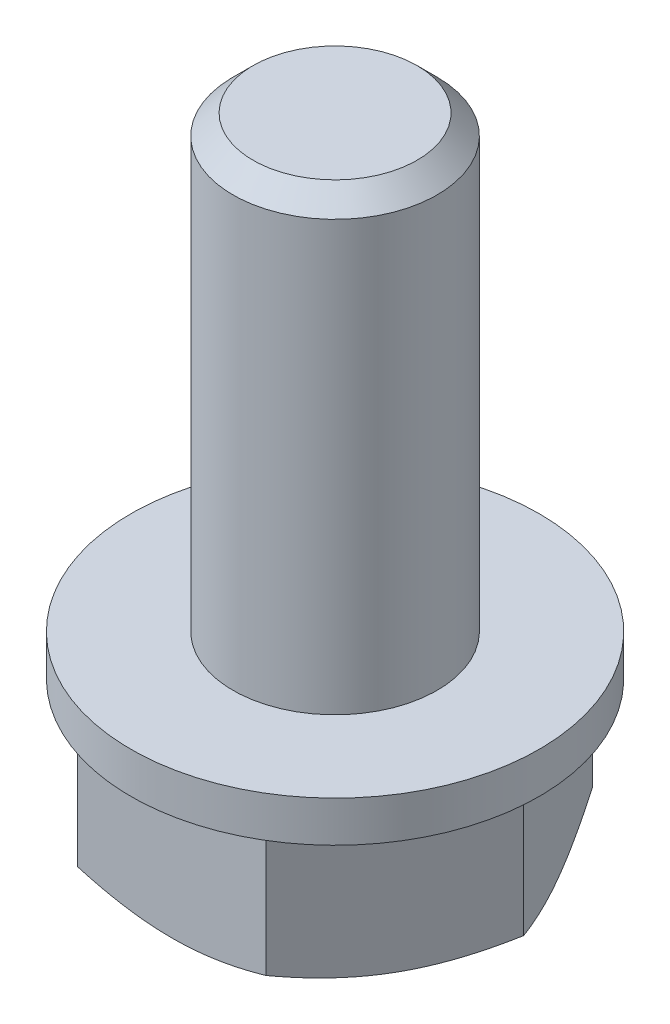
ISO-10303-21;
HEADER;
FILE_DESCRIPTION(('STEP AP214'),'2;1');
FILE_NAME('part.step','',(''),(''),'','','');
FILE_SCHEMA(('AUTOMOTIVE_DESIGN { 1 0 10303 214 1 1 1 1 }'));
ENDSEC;
DATA;
#1=APPLICATION_CONTEXT('core data for automotive mechanical design processes');
#2=APPLICATION_PROTOCOL_DEFINITION('international standard','automotive_design',2000,#1);
#3=PRODUCT_CONTEXT('',#1,'mechanical');
#4=PRODUCT('Part','Part','',(#3));
#5=PRODUCT_RELATED_PRODUCT_CATEGORY('part','',(#4));
#6=PRODUCT_DEFINITION_FORMATION('','',#4);
#7=PRODUCT_DEFINITION_CONTEXT('part definition',#1,'design');
#8=PRODUCT_DEFINITION('design','',#6,#7);
#9=PRODUCT_DEFINITION_SHAPE('','',#8);
#10=(LENGTH_UNIT() NAMED_UNIT(*) SI_UNIT(.MILLI.,.METRE.));
#11=(NAMED_UNIT(*) PLANE_ANGLE_UNIT() SI_UNIT($,.RADIAN.));
#12=(NAMED_UNIT(*) SI_UNIT($,.STERADIAN.) SOLID_ANGLE_UNIT());
#13=UNCERTAINTY_MEASURE_WITH_UNIT(LENGTH_MEASURE(1.E-05),#10,'distance_accuracy_value','');
#14=(GEOMETRIC_REPRESENTATION_CONTEXT(3) GLOBAL_UNCERTAINTY_ASSIGNED_CONTEXT((#13)) GLOBAL_UNIT_ASSIGNED_CONTEXT((#10,
#11,#12)) REPRESENTATION_CONTEXT('',''));
#15=CARTESIAN_POINT('',(0.,0.,0.));
#16=DIRECTION('',(0.,0.,1.));
#17=DIRECTION('',(1.,0.,0.));
#18=AXIS2_PLACEMENT_3D('',#15,#16,#17);
#19=CARTESIAN_POINT('',(12.374368670765,-45.18,10.374368670765));
#20=DIRECTION('',(0.,-1.,0.));
#21=DIRECTION('',(0.,0.,-1.));
#22=AXIS2_PLACEMENT_3D('',#19,#20,#21);
#23=PLANE('',#22);
#24=CARTESIAN_POINT('',(12.374368670765,-45.18,12.374368670765));
#25=DIRECTION('',(0.,-1.,0.));
#26=DIRECTION('',(0.,0.,-1.));
#27=AXIS2_PLACEMENT_3D('',#24,#25,#26);
#28=CIRCLE('',#27,4.);
#29=CARTESIAN_POINT('',(12.374368670765,-45.18,8.374368670765));
#30=VERTEX_POINT('',#29);
#31=CARTESIAN_POINT('',(15.8384702859027,-45.18,10.374368670765));
#32=VERTEX_POINT('',#31);
#33=EDGE_CURVE('E146',#30,#32,#28,.T.);
#34=ORIENTED_EDGE('',*,*,#33,.T.);
#35=CARTESIAN_POINT('',(12.374368670765,-45.18,12.374368670765));
#36=DIRECTION('',(0.,-1.,0.));
#37=DIRECTION('',(0.,0.,-1.));
#38=AXIS2_PLACEMENT_3D('',#35,#36,#37);
#39=CIRCLE('',#38,4.);
#40=CARTESIAN_POINT('',(15.8384702859027,-45.18,14.374368670765));
#41=VERTEX_POINT('',#40);
#42=EDGE_CURVE('E164',#32,#41,#39,.T.);
#43=ORIENTED_EDGE('',*,*,#42,.T.);
#44=CARTESIAN_POINT('',(12.374368670765,-45.18,12.374368670765));
#45=DIRECTION('',(0.,-1.,0.));
#46=DIRECTION('',(0.,0.,-1.));
#47=AXIS2_PLACEMENT_3D('',#44,#45,#46);
#48=CIRCLE('',#47,4.);
#49=CARTESIAN_POINT('',(12.374368670765,-45.18,16.374368670765));
#50=VERTEX_POINT('',#49);
#51=EDGE_CURVE('E142',#41,#50,#48,.T.);
#52=ORIENTED_EDGE('',*,*,#51,.T.);
#53=CARTESIAN_POINT('',(12.374368670765,-45.18,12.374368670765));
#54=DIRECTION('',(0.,-1.,0.));
#55=DIRECTION('',(0.,0.,-1.));
#56=AXIS2_PLACEMENT_3D('',#53,#54,#55);
#57=CIRCLE('',#56,4.);
#58=CARTESIAN_POINT('',(8.91026705562725,-45.18,14.374368670765));
#59=VERTEX_POINT('',#58);
#60=EDGE_CURVE('E138',#50,#59,#57,.T.);
#61=ORIENTED_EDGE('',*,*,#60,.T.);
#62=CARTESIAN_POINT('',(12.374368670765,-45.18,12.374368670765));
#63=DIRECTION('',(0.,-1.,0.));
#64=DIRECTION('',(0.,0.,-1.));
#65=AXIS2_PLACEMENT_3D('',#62,#63,#64);
#66=CIRCLE('',#65,4.);
#67=CARTESIAN_POINT('',(8.91026705562725,-45.18,10.374368670765));
#68=VERTEX_POINT('',#67);
#69=EDGE_CURVE('E108',#59,#68,#66,.T.);
#70=ORIENTED_EDGE('',*,*,#69,.T.);
#71=CARTESIAN_POINT('',(12.374368670765,-45.18,12.374368670765));
#72=DIRECTION('',(0.,-1.,0.));
#73=DIRECTION('',(0.,0.,-1.));
#74=AXIS2_PLACEMENT_3D('',#71,#72,#73);
#75=CIRCLE('',#74,4.);
#76=EDGE_CURVE('E112',#68,#30,#75,.T.);
#77=ORIENTED_EDGE('',*,*,#76,.T.);
#78=EDGE_LOOP('',(#34,#43,#52,#61,#70,#77));
#79=FACE_BOUND('',#78,.T.);
#80=ADVANCED_FACE('F16',(#79),#23,.T.);
#81=CARTESIAN_POINT('',(12.374368670765,-42.6413248654052,12.374368670765));
#82=DIRECTION('',(0.,1.,0.));
#83=DIRECTION('',(0.,0.,-1.));
#84=AXIS2_PLACEMENT_3D('',#81,#82,#83);
#85=CYLINDRICAL_SURFACE('',#84,5.);
#86=CARTESIAN_POINT('',(12.374368670765,-40.68,12.374368670765));
#87=DIRECTION('',(0.,-1.,0.));
#88=DIRECTION('',(0.,0.,-1.));
#89=AXIS2_PLACEMENT_3D('',#86,#87,#88);
#90=CIRCLE('',#89,5.);
#91=CARTESIAN_POINT('',(12.374368670765,-40.68,7.374368670765));
#92=VERTEX_POINT('',#91);
#93=EDGE_CURVE('E11',#92,#92,#90,.T.);
#94=ORIENTED_EDGE('',*,*,#93,.T.);
#95=EDGE_LOOP('',(#94));
#96=FACE_BOUND('',#95,.T.);
#97=CARTESIAN_POINT('',(12.374368670765,-41.68,12.374368670765));
#98=DIRECTION('',(0.,1.,0.));
#99=DIRECTION('',(0.,0.,-1.));
#100=AXIS2_PLACEMENT_3D('',#97,#98,#99);
#101=CIRCLE('',#100,5.);
#102=CARTESIAN_POINT('',(12.374368670765,-41.68,7.374368670765));
#103=VERTEX_POINT('',#102);
#104=EDGE_CURVE('E105',#103,#103,#101,.T.);
#105=ORIENTED_EDGE('',*,*,#104,.T.);
#106=EDGE_LOOP('',(#105));
#107=FACE_BOUND('',#106,.T.);
#108=ADVANCED_FACE('F106',(#96,#107),#85,.T.);
#109=CARTESIAN_POINT('',(12.374368670765,-40.68,8.624368670765));
#110=DIRECTION('',(0.,1.,0.));
#111=DIRECTION('',(0.,0.,1.));
#112=AXIS2_PLACEMENT_3D('',#109,#110,#111);
#113=PLANE('',#112);
#114=CARTESIAN_POINT('',(12.374368670765,-40.68,12.374368670765));
#115=DIRECTION('',(0.,-1.,0.));
#116=DIRECTION('',(0.,0.,-1.));
#117=AXIS2_PLACEMENT_3D('',#114,#115,#116);
#118=CIRCLE('',#117,2.5);
#119=CARTESIAN_POINT('',(12.374368670765,-40.68,9.874368670765));
#120=VERTEX_POINT('',#119);
#121=EDGE_CURVE('E26',#120,#120,#118,.T.);
#122=ORIENTED_EDGE('',*,*,#121,.T.);
#123=EDGE_LOOP('',(#122));
#124=FACE_BOUND('',#123,.T.);
#125=ORIENTED_EDGE('',*,*,#93,.F.);
#126=EDGE_LOOP('',(#125));
#127=FACE_BOUND('',#126,.T.);
#128=ADVANCED_FACE('F304',(#124,#127),#113,.T.);
#129=CARTESIAN_POINT('',(12.374368670765,-35.42525,12.374368670765));
#130=DIRECTION('',(0.,1.,0.));
#131=DIRECTION('',(0.,0.,-1.));
#132=AXIS2_PLACEMENT_3D('',#129,#130,#131);
#133=CYLINDRICAL_SURFACE('',#132,2.5);
#134=CARTESIAN_POINT('',(12.374368670765,-30.1705,12.374368670765));
#135=DIRECTION('',(0.,-1.,0.));
#136=DIRECTION('',(0.,0.,-1.));
#137=AXIS2_PLACEMENT_3D('',#134,#135,#136);
#138=CIRCLE('',#137,2.5);
#139=CARTESIAN_POINT('',(12.374368670765,-30.1705,9.874368670765));
#140=VERTEX_POINT('',#139);
#141=EDGE_CURVE('E130',#140,#140,#138,.T.);
#142=ORIENTED_EDGE('',*,*,#141,.T.);
#143=EDGE_LOOP('',(#142));
#144=FACE_BOUND('',#143,.T.);
#145=ORIENTED_EDGE('',*,*,#121,.F.);
#146=EDGE_LOOP('',(#145));
#147=FACE_BOUND('',#146,.T.);
#148=ADVANCED_FACE('F323',(#144,#147),#133,.T.);
#149=CARTESIAN_POINT('',(12.374368670765,-29.92525,12.374368670765));
#150=DIRECTION('',(0.,-1.,0.));
#151=DIRECTION('',(0.,0.,-1.));
#152=AXIS2_PLACEMENT_3D('',#149,#150,#151);
#153=CONICAL_SURFACE('',#152,2.25475,0.785398163397448);
#154=CARTESIAN_POINT('',(12.374368670765,-29.68,12.374368670765));
#155=DIRECTION('',(0.,-1.,0.));
#156=DIRECTION('',(0.,0.,-1.));
#157=AXIS2_PLACEMENT_3D('',#154,#155,#156);
#158=CIRCLE('',#157,2.0095);
#159=CARTESIAN_POINT('',(12.374368670765,-29.68,10.364868670765));
#160=VERTEX_POINT('',#159);
#161=EDGE_CURVE('E134',#160,#160,#158,.T.);
#162=ORIENTED_EDGE('',*,*,#161,.T.);
#163=EDGE_LOOP('',(#162));
#164=FACE_BOUND('',#163,.T.);
#165=ORIENTED_EDGE('',*,*,#141,.F.);
#166=EDGE_LOOP('',(#165));
#167=FACE_BOUND('',#166,.T.);
#168=ADVANCED_FACE('F320',(#164,#167),#153,.T.);
#169=CARTESIAN_POINT('',(12.374368670765,-29.68,11.369618670765));
#170=DIRECTION('',(0.,1.,0.));
#171=DIRECTION('',(0.,0.,1.));
#172=AXIS2_PLACEMENT_3D('',#169,#170,#171);
#173=PLANE('',#172);
#174=ORIENTED_EDGE('',*,*,#161,.F.);
#175=EDGE_LOOP('',(#174));
#176=FACE_BOUND('',#175,.T.);
#177=ADVANCED_FACE('F18',(#176),#173,.T.);
#178=CARTESIAN_POINT('',(12.374368670765,-44.8913248654052,12.374368670765));
#179=DIRECTION('',(0.,1.,0.));
#180=DIRECTION('',(0.,0.,-1.));
#181=AXIS2_PLACEMENT_3D('',#178,#179,#180);
#182=CONICAL_SURFACE('',#181,4.5,1.04719755119662);
#183=CARTESIAN_POINT('',(12.374368670765,-45.18,16.374368670765));
#184=CARTESIAN_POINT('',(11.302571901033,-45.18,16.374368670765));
#185=CARTESIAN_POINT('',(10.0649675940065,-44.8227344100918,16.374368670765));
#186=(BOUNDED_CURVE() B_SPLINE_CURVE(2,(#183,#184,#185),.UNSPECIFIED.,.F.,
.F.) B_SPLINE_CURVE_WITH_KNOTS((3,3),(3.06610202231448,5.50179922142013),
.UNSPECIFIED.) CURVE() GEOMETRIC_REPRESENTATION_ITEM() RATIONAL_B_SPLINE_CURVE((1.,
1.04818815858901,1.01981541864881)) REPRESENTATION_ITEM(''));
#187=CARTESIAN_POINT('',(10.0649675940065,-44.8227344100919,16.374368670765));
#188=VERTEX_POINT('',#187);
#189=EDGE_CURVE('E181',#50,#188,#186,.T.);
#190=ORIENTED_EDGE('',*,*,#189,.T.);
#191=CARTESIAN_POINT('',(10.0649675940065,-44.8227344100918,16.374368670765));
#192=CARTESIAN_POINT('',(9.44616544048951,-45.1799999999999,15.3025719010405));
#193=CARTESIAN_POINT('',(8.91026705562725,-45.18,14.374368670765));
#194=(BOUNDED_CURVE() B_SPLINE_CURVE(2,(#191,#192,#193),.UNSPECIFIED.,.F.,
.F.) B_SPLINE_CURVE_WITH_KNOTS((3,3),(0.630404823226759,3.06610202231449),
.UNSPECIFIED.) CURVE() GEOMETRIC_REPRESENTATION_ITEM() RATIONAL_B_SPLINE_CURVE((1.01981541864924,
1.04818815858868,1.)) REPRESENTATION_ITEM(''));
#195=EDGE_CURVE('E114',#188,#59,#194,.T.);
#196=ORIENTED_EDGE('',*,*,#195,.T.);
#197=ORIENTED_EDGE('',*,*,#60,.F.);
#198=EDGE_LOOP('',(#190,#196,#197));
#199=FACE_BOUND('',#198,.T.);
#200=ADVANCED_FACE('F256',(#199),#182,.T.);
#201=CARTESIAN_POINT('',(12.374368670765,-44.8913248654052,12.374368670765));
#202=DIRECTION('',(0.,1.,0.));
#203=DIRECTION('',(0.,0.,-1.));
#204=AXIS2_PLACEMENT_3D('',#201,#202,#203);
#205=CONICAL_SURFACE('',#204,4.5,1.04719755119662);
#206=CARTESIAN_POINT('',(15.8384702859027,-45.18,14.374368670765));
#207=CARTESIAN_POINT('',(15.3025719010368,-45.18,15.3025719010471));
#208=CARTESIAN_POINT('',(14.6837697475235,-44.8227344100919,16.374368670765));
#209=(BOUNDED_CURVE() B_SPLINE_CURVE(2,(#206,#207,#208),.UNSPECIFIED.,.F.,
.F.) B_SPLINE_CURVE_WITH_KNOTS((3,3),(3.06610202231449,5.50179922142015),
.UNSPECIFIED.) CURVE() GEOMETRIC_REPRESENTATION_ITEM() RATIONAL_B_SPLINE_CURVE((1.,
1.04818815858904,1.01981541864882)) REPRESENTATION_ITEM(''));
#210=CARTESIAN_POINT('',(14.6837697475235,-44.8227344100919,16.374368670765));
#211=VERTEX_POINT('',#210);
#212=EDGE_CURVE('E150',#41,#211,#209,.T.);
#213=ORIENTED_EDGE('',*,*,#212,.T.);
#214=CARTESIAN_POINT('',(14.6837697475235,-44.8227344100919,16.374368670765));
#215=CARTESIAN_POINT('',(13.4461654404895,-45.1800000000001,16.374368670765));
#216=CARTESIAN_POINT('',(12.374368670765,-45.18,16.374368670765));
#217=(BOUNDED_CURVE() B_SPLINE_CURVE(2,(#214,#215,#216),.UNSPECIFIED.,.F.,
.F.) B_SPLINE_CURVE_WITH_KNOTS((3,3),(0.630404823226771,3.06610202231448),
.UNSPECIFIED.) CURVE() GEOMETRIC_REPRESENTATION_ITEM() RATIONAL_B_SPLINE_CURVE((1.01981541864923,
1.04818815858865,1.)) REPRESENTATION_ITEM(''));
#218=EDGE_CURVE('E156',#211,#50,#217,.T.);
#219=ORIENTED_EDGE('',*,*,#218,.T.);
#220=ORIENTED_EDGE('',*,*,#51,.F.);
#221=EDGE_LOOP('',(#213,#219,#220));
#222=FACE_BOUND('',#221,.T.);
#223=ADVANCED_FACE('F271',(#222),#205,.T.);
#224=CARTESIAN_POINT('',(12.374368670765,-44.8913248654052,12.374368670765));
#225=DIRECTION('',(0.,1.,0.));
#226=DIRECTION('',(0.,0.,-1.));
#227=AXIS2_PLACEMENT_3D('',#224,#225,#226);
#228=CONICAL_SURFACE('',#227,4.5,1.04719755119662);
#229=CARTESIAN_POINT('',(15.8384702859027,-45.18,10.374368670765));
#230=CARTESIAN_POINT('',(16.3743686707688,-45.18,11.302571901047));
#231=CARTESIAN_POINT('',(16.993170824282,-44.8227344100919,12.374368670765));
#232=(BOUNDED_CURVE() B_SPLINE_CURVE(2,(#229,#230,#231),.UNSPECIFIED.,.F.,
.F.) B_SPLINE_CURVE_WITH_KNOTS((3,3),(3.06610202231449,5.50179922142014),
.UNSPECIFIED.) CURVE() GEOMETRIC_REPRESENTATION_ITEM() RATIONAL_B_SPLINE_CURVE((1.,
1.04818815858902,1.01981541864881)) REPRESENTATION_ITEM(''));
#233=CARTESIAN_POINT('',(16.993170824282,-44.8227344100919,12.374368670765));
#234=VERTEX_POINT('',#233);
#235=EDGE_CURVE('E122',#32,#234,#232,.T.);
#236=ORIENTED_EDGE('',*,*,#235,.T.);
#237=CARTESIAN_POINT('',(16.993170824282,-44.8227344100919,12.374368670765));
#238=CARTESIAN_POINT('',(16.374368670765,-45.1800000000001,13.4461654404895));
#239=CARTESIAN_POINT('',(15.8384702859027,-45.18,14.374368670765));
#240=(BOUNDED_CURVE() B_SPLINE_CURVE(2,(#237,#238,#239),.UNSPECIFIED.,.F.,
.F.) B_SPLINE_CURVE_WITH_KNOTS((3,3),(0.630404823226775,3.06610202231449),
.UNSPECIFIED.) CURVE() GEOMETRIC_REPRESENTATION_ITEM() RATIONAL_B_SPLINE_CURVE((1.01981541864923,
1.04818815858866,1.)) REPRESENTATION_ITEM(''));
#241=EDGE_CURVE('E50',#234,#41,#240,.T.);
#242=ORIENTED_EDGE('',*,*,#241,.T.);
#243=ORIENTED_EDGE('',*,*,#42,.F.);
#244=EDGE_LOOP('',(#236,#242,#243));
#245=FACE_BOUND('',#244,.T.);
#246=ADVANCED_FACE('F288',(#245),#228,.T.);
#247=CARTESIAN_POINT('',(12.374368670765,-44.8913248654052,12.374368670765));
#248=DIRECTION('',(0.,1.,0.));
#249=DIRECTION('',(0.,0.,-1.));
#250=AXIS2_PLACEMENT_3D('',#247,#248,#249);
#251=CONICAL_SURFACE('',#250,4.5,1.04719755119662);
#252=CARTESIAN_POINT('',(14.6837697475235,-44.8227344100918,8.374368670765));
#253=CARTESIAN_POINT('',(15.3025719010405,-45.1799999999999,9.44616544048947));
#254=CARTESIAN_POINT('',(15.8384702859027,-45.18,10.374368670765));
#255=(BOUNDED_CURVE() B_SPLINE_CURVE(2,(#252,#253,#254),.UNSPECIFIED.,.F.,
.F.) B_SPLINE_CURVE_WITH_KNOTS((3,3),(0.630404823226759,3.06610202231449),
.UNSPECIFIED.) CURVE() GEOMETRIC_REPRESENTATION_ITEM() RATIONAL_B_SPLINE_CURVE((1.01981541864924,
1.04818815858868,1.)) REPRESENTATION_ITEM(''));
#256=CARTESIAN_POINT('',(14.6837697475235,-44.8227344100919,8.374368670765));
#257=VERTEX_POINT('',#256);
#258=EDGE_CURVE('E221',#257,#32,#255,.T.);
#259=ORIENTED_EDGE('',*,*,#258,.T.);
#260=ORIENTED_EDGE('',*,*,#33,.F.);
#261=CARTESIAN_POINT('',(12.374368670765,-45.18,8.374368670765));
#262=CARTESIAN_POINT('',(13.446165440497,-45.18,8.374368670765));
#263=CARTESIAN_POINT('',(14.6837697475235,-44.8227344100918,8.37436867076499));
#264=(BOUNDED_CURVE() B_SPLINE_CURVE(2,(#261,#262,#263),.UNSPECIFIED.,.F.,
.F.) B_SPLINE_CURVE_WITH_KNOTS((3,3),(3.06610202231448,5.50179922142013),
.UNSPECIFIED.) CURVE() GEOMETRIC_REPRESENTATION_ITEM() RATIONAL_B_SPLINE_CURVE((1.,
1.04818815858901,1.01981541864881)) REPRESENTATION_ITEM(''));
#265=EDGE_CURVE('E196',#30,#257,#264,.T.);
#266=ORIENTED_EDGE('',*,*,#265,.T.);
#267=EDGE_LOOP('',(#259,#260,#266));
#268=FACE_BOUND('',#267,.T.);
#269=ADVANCED_FACE('F286',(#268),#251,.T.);
#270=CARTESIAN_POINT('',(12.374368670765,-44.8913248654052,12.374368670765));
#271=DIRECTION('',(0.,1.,0.));
#272=DIRECTION('',(0.,0.,-1.));
#273=AXIS2_PLACEMENT_3D('',#270,#271,#272);
#274=CONICAL_SURFACE('',#273,4.5,1.04719755119662);
#275=CARTESIAN_POINT('',(10.0649675940065,-44.8227344100919,8.37436867076501));
#276=CARTESIAN_POINT('',(11.3025719010405,-45.1800000000001,8.37436867076501));
#277=CARTESIAN_POINT('',(12.374368670765,-45.18,8.374368670765));
#278=(BOUNDED_CURVE() B_SPLINE_CURVE(2,(#275,#276,#277),.UNSPECIFIED.,.F.,
.F.) B_SPLINE_CURVE_WITH_KNOTS((3,3),(0.630404823226771,3.06610202231448),
.UNSPECIFIED.) CURVE() GEOMETRIC_REPRESENTATION_ITEM() RATIONAL_B_SPLINE_CURVE((1.01981541864923,
1.04818815858865,1.)) REPRESENTATION_ITEM(''));
#279=CARTESIAN_POINT('',(10.0649675940065,-44.8227344100919,8.374368670765));
#280=VERTEX_POINT('',#279);
#281=EDGE_CURVE('E202',#280,#30,#278,.T.);
#282=ORIENTED_EDGE('',*,*,#281,.T.);
#283=ORIENTED_EDGE('',*,*,#76,.F.);
#284=CARTESIAN_POINT('',(8.91026705562725,-45.18,10.374368670765));
#285=CARTESIAN_POINT('',(9.44616544049328,-45.18,9.44616544048297));
#286=CARTESIAN_POINT('',(10.0649675940065,-44.8227344100919,8.37436867076499));
#287=(BOUNDED_CURVE() B_SPLINE_CURVE(2,(#284,#285,#286),.UNSPECIFIED.,.F.,
.F.) B_SPLINE_CURVE_WITH_KNOTS((3,3),(3.06610202231449,5.50179922142015),
.UNSPECIFIED.) CURVE() GEOMETRIC_REPRESENTATION_ITEM() RATIONAL_B_SPLINE_CURVE((1.,
1.04818815858904,1.01981541864882)) REPRESENTATION_ITEM(''));
#288=EDGE_CURVE('E129',#68,#280,#287,.T.);
#289=ORIENTED_EDGE('',*,*,#288,.T.);
#290=EDGE_LOOP('',(#282,#283,#289));
#291=FACE_BOUND('',#290,.T.);
#292=ADVANCED_FACE('F285',(#291),#274,.T.);
#293=CARTESIAN_POINT('',(12.374368670765,-44.8913248654052,12.374368670765));
#294=DIRECTION('',(0.,1.,0.));
#295=DIRECTION('',(0.,0.,-1.));
#296=AXIS2_PLACEMENT_3D('',#293,#294,#295);
#297=CONICAL_SURFACE('',#296,4.5,1.04719755119662);
#298=CARTESIAN_POINT('',(7.755566517248,-44.8227344100919,12.374368670765));
#299=CARTESIAN_POINT('',(8.37436867076501,-45.1800000000001,11.3025719010405));
#300=CARTESIAN_POINT('',(8.91026705562725,-45.18,10.374368670765));
#301=(BOUNDED_CURVE() B_SPLINE_CURVE(2,(#298,#299,#300),.UNSPECIFIED.,.F.,
.F.) B_SPLINE_CURVE_WITH_KNOTS((3,3),(0.630404823226775,3.06610202231449),
.UNSPECIFIED.) CURVE() GEOMETRIC_REPRESENTATION_ITEM() RATIONAL_B_SPLINE_CURVE((1.01981541864923,
1.04818815858866,1.)) REPRESENTATION_ITEM(''));
#302=CARTESIAN_POINT('',(7.755566517248,-44.8227344100919,12.374368670765));
#303=VERTEX_POINT('',#302);
#304=EDGE_CURVE('E124',#303,#68,#301,.T.);
#305=ORIENTED_EDGE('',*,*,#304,.T.);
#306=ORIENTED_EDGE('',*,*,#69,.F.);
#307=CARTESIAN_POINT('',(8.91026705562725,-45.18,14.374368670765));
#308=CARTESIAN_POINT('',(8.37436867076123,-45.18,13.446165440483));
#309=CARTESIAN_POINT('',(7.75556651724801,-44.8227344100919,12.374368670765));
#310=(BOUNDED_CURVE() B_SPLINE_CURVE(2,(#307,#308,#309),.UNSPECIFIED.,.F.,
.F.) B_SPLINE_CURVE_WITH_KNOTS((3,3),(3.06610202231449,5.50179922142014),
.UNSPECIFIED.) CURVE() GEOMETRIC_REPRESENTATION_ITEM() RATIONAL_B_SPLINE_CURVE((1.,
1.04818815858902,1.01981541864881)) REPRESENTATION_ITEM(''));
#311=EDGE_CURVE('E207',#59,#303,#310,.T.);
#312=ORIENTED_EDGE('',*,*,#311,.T.);
#313=EDGE_LOOP('',(#305,#306,#312));
#314=FACE_BOUND('',#313,.T.);
#315=ADVANCED_FACE('F266',(#314),#297,.T.);
#316=CARTESIAN_POINT('',(12.374368670765,-41.68,12.374368670765));
#317=DIRECTION('',(0.,-1.,0.));
#318=DIRECTION('',(-1.,0.,0.));
#319=AXIS2_PLACEMENT_3D('',#316,#317,#318);
#320=PLANE('',#319);
#321=DIRECTION('',(0.5,0.,-0.866025403784439));
#322=VECTOR('',#321,1.);
#323=CARTESIAN_POINT('',(16.993170824282,-41.68,12.374368670765));
#324=LINE('',#323,#322);
#325=CARTESIAN_POINT('',(14.6837697475235,-41.68,16.374368670765));
#326=VERTEX_POINT('',#325);
#327=CARTESIAN_POINT('',(16.993170824282,-41.68,12.374368670765));
#328=VERTEX_POINT('',#327);
#329=EDGE_CURVE('E61',#326,#328,#324,.T.);
#330=ORIENTED_EDGE('',*,*,#329,.T.);
#331=DIRECTION('',(-0.5,0.,-0.866025403784439));
#332=VECTOR('',#331,1.);
#333=CARTESIAN_POINT('',(14.6837697475235,-41.68,8.374368670765));
#334=LINE('',#333,#332);
#335=CARTESIAN_POINT('',(14.6837697475235,-41.68,8.374368670765));
#336=VERTEX_POINT('',#335);
#337=EDGE_CURVE('E123',#328,#336,#334,.T.);
#338=ORIENTED_EDGE('',*,*,#337,.T.);
#339=DIRECTION('',(-1.,0.,0.));
#340=VECTOR('',#339,1.);
#341=CARTESIAN_POINT('',(10.0649675940065,-41.68,8.374368670765));
#342=LINE('',#341,#340);
#343=CARTESIAN_POINT('',(10.0649675940065,-41.68,8.374368670765));
#344=VERTEX_POINT('',#343);
#345=EDGE_CURVE('E169',#336,#344,#342,.T.);
#346=ORIENTED_EDGE('',*,*,#345,.T.);
#347=DIRECTION('',(-0.5,0.,0.866025403784439));
#348=VECTOR('',#347,1.);
#349=CARTESIAN_POINT('',(7.755566517248,-41.68,12.374368670765));
#350=LINE('',#349,#348);
#351=CARTESIAN_POINT('',(7.755566517248,-41.68,12.374368670765));
#352=VERTEX_POINT('',#351);
#353=EDGE_CURVE('E20',#344,#352,#350,.T.);
#354=ORIENTED_EDGE('',*,*,#353,.T.);
#355=DIRECTION('',(0.5,0.,0.866025403784439));
#356=VECTOR('',#355,1.);
#357=CARTESIAN_POINT('',(10.0649675940065,-41.68,16.374368670765));
#358=LINE('',#357,#356);
#359=CARTESIAN_POINT('',(10.0649675940065,-41.68,16.374368670765));
#360=VERTEX_POINT('',#359);
#361=EDGE_CURVE('E109',#352,#360,#358,.T.);
#362=ORIENTED_EDGE('',*,*,#361,.T.);
#363=DIRECTION('',(1.,0.,0.));
#364=VECTOR('',#363,1.);
#365=CARTESIAN_POINT('',(14.6837697475235,-41.68,16.374368670765));
#366=LINE('',#365,#364);
#367=EDGE_CURVE('E182',#360,#326,#366,.T.);
#368=ORIENTED_EDGE('',*,*,#367,.T.);
#369=EDGE_LOOP('',(#330,#338,#346,#354,#362,#368));
#370=FACE_BOUND('',#369,.T.);
#371=ORIENTED_EDGE('',*,*,#104,.F.);
#372=EDGE_LOOP('',(#371));
#373=FACE_BOUND('',#372,.T.);
#374=ADVANCED_FACE('F276',(#370,#373),#320,.T.);
#375=CARTESIAN_POINT('',(7.755566517248,-45.18,12.374368670765));
#376=DIRECTION('',(0.866025403784439,0.,-0.5));
#377=DIRECTION('',(-0.5,0.,-0.866025403784439));
#378=AXIS2_PLACEMENT_3D('',#375,#376,#377);
#379=PLANE('',#378);
#380=ORIENTED_EDGE('',*,*,#311,.F.);
#381=ORIENTED_EDGE('',*,*,#195,.F.);
#382=DIRECTION('',(0.,1.,0.));
#383=VECTOR('',#382,1.);
#384=CARTESIAN_POINT('',(10.0649675940065,-45.18,16.374368670765));
#385=LINE('',#384,#383);
#386=EDGE_CURVE('E178',#188,#360,#385,.T.);
#387=ORIENTED_EDGE('',*,*,#386,.T.);
#388=ORIENTED_EDGE('',*,*,#361,.F.);
#389=DIRECTION('',(0.,1.,0.));
#390=VECTOR('',#389,1.);
#391=CARTESIAN_POINT('',(7.755566517248,-45.18,12.374368670765));
#392=LINE('',#391,#390);
#393=EDGE_CURVE('E128',#303,#352,#392,.T.);
#394=ORIENTED_EDGE('',*,*,#393,.F.);
#395=EDGE_LOOP('',(#380,#381,#387,#388,#394));
#396=FACE_BOUND('',#395,.T.);
#397=ADVANCED_FACE('F260',(#396),#379,.F.);
#398=CARTESIAN_POINT('',(10.0649675940065,-45.18,8.374368670765));
#399=DIRECTION('',(0.866025403784439,0.,0.5));
#400=DIRECTION('',(0.5,0.,-0.866025403784439));
#401=AXIS2_PLACEMENT_3D('',#398,#399,#400);
#402=PLANE('',#401);
#403=ORIENTED_EDGE('',*,*,#288,.F.);
#404=ORIENTED_EDGE('',*,*,#304,.F.);
#405=ORIENTED_EDGE('',*,*,#393,.T.);
#406=ORIENTED_EDGE('',*,*,#353,.F.);
#407=DIRECTION('',(0.,1.,0.));
#408=VECTOR('',#407,1.);
#409=CARTESIAN_POINT('',(10.0649675940065,-45.18,8.374368670765));
#410=LINE('',#409,#408);
#411=EDGE_CURVE('E175',#280,#344,#410,.T.);
#412=ORIENTED_EDGE('',*,*,#411,.F.);
#413=EDGE_LOOP('',(#403,#404,#405,#406,#412));
#414=FACE_BOUND('',#413,.T.);
#415=ADVANCED_FACE('F283',(#414),#402,.F.);
#416=CARTESIAN_POINT('',(14.6837697475235,-45.18,8.374368670765));
#417=DIRECTION('',(0.,0.,1.));
#418=DIRECTION('',(1.,0.,0.));
#419=AXIS2_PLACEMENT_3D('',#416,#417,#418);
#420=PLANE('',#419);
#421=ORIENTED_EDGE('',*,*,#265,.F.);
#422=ORIENTED_EDGE('',*,*,#281,.F.);
#423=ORIENTED_EDGE('',*,*,#411,.T.);
#424=ORIENTED_EDGE('',*,*,#345,.F.);
#425=DIRECTION('',(0.,1.,0.));
#426=VECTOR('',#425,1.);
#427=CARTESIAN_POINT('',(14.6837697475235,-45.18,8.374368670765));
#428=LINE('',#427,#426);
#429=EDGE_CURVE('E177',#257,#336,#428,.T.);
#430=ORIENTED_EDGE('',*,*,#429,.F.);
#431=EDGE_LOOP('',(#421,#422,#423,#424,#430));
#432=FACE_BOUND('',#431,.T.);
#433=ADVANCED_FACE('F281',(#432),#420,.F.);
#434=CARTESIAN_POINT('',(10.0649675940065,-45.18,16.374368670765));
#435=DIRECTION('',(0.,0.,-1.));
#436=DIRECTION('',(-1.,0.,0.));
#437=AXIS2_PLACEMENT_3D('',#434,#435,#436);
#438=PLANE('',#437);
#439=ORIENTED_EDGE('',*,*,#218,.F.);
#440=DIRECTION('',(0.,1.,0.));
#441=VECTOR('',#440,1.);
#442=CARTESIAN_POINT('',(14.6837697475235,-45.18,16.374368670765));
#443=LINE('',#442,#441);
#444=EDGE_CURVE('E148',#211,#326,#443,.T.);
#445=ORIENTED_EDGE('',*,*,#444,.T.);
#446=ORIENTED_EDGE('',*,*,#367,.F.);
#447=ORIENTED_EDGE('',*,*,#386,.F.);
#448=ORIENTED_EDGE('',*,*,#189,.F.);
#449=EDGE_LOOP('',(#439,#445,#446,#447,#448));
#450=FACE_BOUND('',#449,.T.);
#451=ADVANCED_FACE('F258',(#450),#438,.F.);
#452=CARTESIAN_POINT('',(14.6837697475235,-45.18,16.374368670765));
#453=DIRECTION('',(-0.866025403784439,0.,-0.5));
#454=DIRECTION('',(-0.5,0.,0.866025403784439));
#455=AXIS2_PLACEMENT_3D('',#452,#453,#454);
#456=PLANE('',#455);
#457=ORIENTED_EDGE('',*,*,#241,.F.);
#458=DIRECTION('',(0.,1.,0.));
#459=VECTOR('',#458,1.);
#460=CARTESIAN_POINT('',(16.993170824282,-45.18,12.374368670765));
#461=LINE('',#460,#459);
#462=EDGE_CURVE('E120',#234,#328,#461,.T.);
#463=ORIENTED_EDGE('',*,*,#462,.T.);
#464=ORIENTED_EDGE('',*,*,#329,.F.);
#465=ORIENTED_EDGE('',*,*,#444,.F.);
#466=ORIENTED_EDGE('',*,*,#212,.F.);
#467=EDGE_LOOP('',(#457,#463,#464,#465,#466));
#468=FACE_BOUND('',#467,.T.);
#469=ADVANCED_FACE('F272',(#468),#456,.F.);
#470=CARTESIAN_POINT('',(16.993170824282,-45.18,12.374368670765));
#471=DIRECTION('',(-0.866025403784439,0.,0.5));
#472=DIRECTION('',(0.5,0.,0.866025403784439));
#473=AXIS2_PLACEMENT_3D('',#470,#471,#472);
#474=PLANE('',#473);
#475=ORIENTED_EDGE('',*,*,#258,.F.);
#476=ORIENTED_EDGE('',*,*,#429,.T.);
#477=ORIENTED_EDGE('',*,*,#337,.F.);
#478=ORIENTED_EDGE('',*,*,#462,.F.);
#479=ORIENTED_EDGE('',*,*,#235,.F.);
#480=EDGE_LOOP('',(#475,#476,#477,#478,#479));
#481=FACE_BOUND('',#480,.T.);
#482=ADVANCED_FACE('F275',(#481),#474,.F.);
#483=CLOSED_SHELL('',(#80,#108,#128,#148,#168,#177,#200,#223,#246,#269,#292,#315,#374,#397,#415,
#433,#451,#469,#482));
#484=MANIFOLD_SOLID_BREP('B1',#483);
#485=ADVANCED_BREP_SHAPE_REPRESENTATION('',(#18,#484),#14);
#486=SHAPE_DEFINITION_REPRESENTATION(#9,#485);
ENDSEC;
END-ISO-10303-21;
